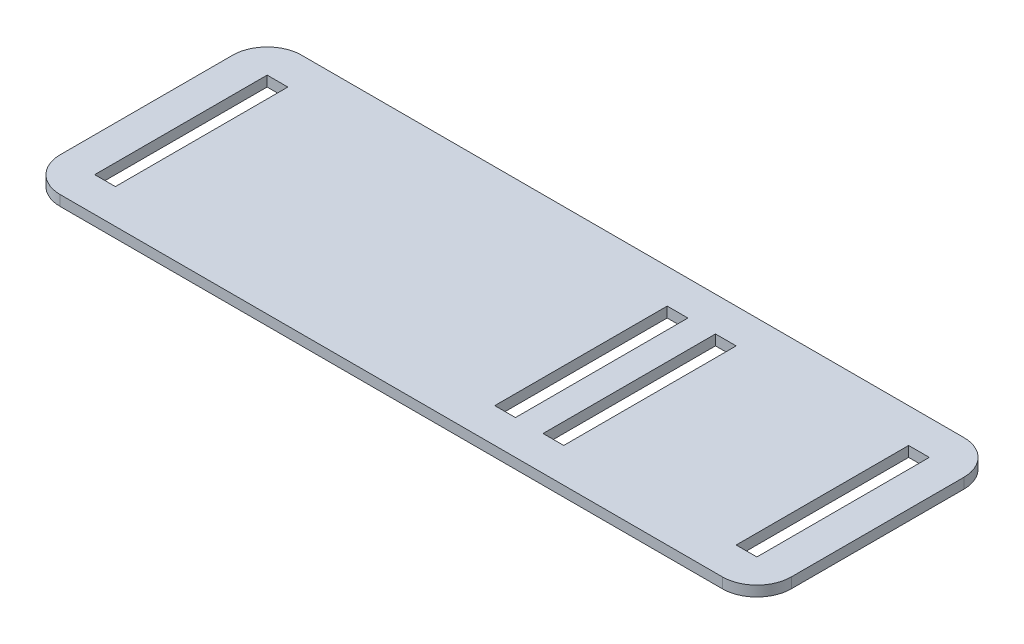
ISO-10303-21;
HEADER;
FILE_DESCRIPTION(('STEP AP214'),'2;1');
FILE_NAME('part.step','',(''),(''),'','','');
FILE_SCHEMA(('AUTOMOTIVE_DESIGN { 1 0 10303 214 1 1 1 1 }'));
ENDSEC;
DATA;
#1=APPLICATION_CONTEXT('core data for automotive mechanical design processes');
#2=APPLICATION_PROTOCOL_DEFINITION('international standard','automotive_design',2000,#1);
#3=PRODUCT_CONTEXT('',#1,'mechanical');
#4=PRODUCT('Part','Part','',(#3));
#5=PRODUCT_RELATED_PRODUCT_CATEGORY('part','',(#4));
#6=PRODUCT_DEFINITION_FORMATION('','',#4);
#7=PRODUCT_DEFINITION_CONTEXT('part definition',#1,'design');
#8=PRODUCT_DEFINITION('design','',#6,#7);
#9=PRODUCT_DEFINITION_SHAPE('','',#8);
#10=(LENGTH_UNIT() NAMED_UNIT(*) SI_UNIT(.MILLI.,.METRE.));
#11=(NAMED_UNIT(*) PLANE_ANGLE_UNIT() SI_UNIT($,.RADIAN.));
#12=(NAMED_UNIT(*) SI_UNIT($,.STERADIAN.) SOLID_ANGLE_UNIT());
#13=UNCERTAINTY_MEASURE_WITH_UNIT(LENGTH_MEASURE(1.E-05),#10,'distance_accuracy_value','');
#14=(GEOMETRIC_REPRESENTATION_CONTEXT(3) GLOBAL_UNCERTAINTY_ASSIGNED_CONTEXT((#13)) GLOBAL_UNIT_ASSIGNED_CONTEXT((#10,
#11,#12)) REPRESENTATION_CONTEXT('',''));
#15=CARTESIAN_POINT('',(0.,0.,0.));
#16=DIRECTION('',(0.,0.,1.));
#17=DIRECTION('',(1.,0.,0.));
#18=AXIS2_PLACEMENT_3D('',#15,#16,#17);
#19=CARTESIAN_POINT('',(106.,3.,35.));
#20=DIRECTION('',(-1.,0.,0.));
#21=DIRECTION('',(0.,0.,1.));
#22=AXIS2_PLACEMENT_3D('',#19,#20,#21);
#23=PLANE('',#22);
#24=DIRECTION('',(0.,0.,-1.));
#25=VECTOR('',#24,1.);
#26=CARTESIAN_POINT('',(106.,3.,35.));
#27=LINE('',#26,#25);
#28=CARTESIAN_POINT('',(106.,3.,25.));
#29=VERTEX_POINT('',#28);
#30=CARTESIAN_POINT('',(106.,3.,-25.));
#31=VERTEX_POINT('',#30);
#32=EDGE_CURVE('E348',#29,#31,#27,.T.);
#33=ORIENTED_EDGE('',*,*,#32,.F.);
#34=DIRECTION('',(0.,-1.,0.));
#35=VECTOR('',#34,1.);
#36=CARTESIAN_POINT('',(106.,3.,25.));
#37=LINE('',#36,#35);
#38=CARTESIAN_POINT('',(106.,0.,25.));
#39=VERTEX_POINT('',#38);
#40=EDGE_CURVE('E395',#29,#39,#37,.T.);
#41=ORIENTED_EDGE('',*,*,#40,.T.);
#42=DIRECTION('',(0.,0.,-1.));
#43=VECTOR('',#42,1.);
#44=CARTESIAN_POINT('',(106.,0.,35.));
#45=LINE('',#44,#43);
#46=CARTESIAN_POINT('',(106.,0.,-25.));
#47=VERTEX_POINT('',#46);
#48=EDGE_CURVE('E347',#39,#47,#45,.T.);
#49=ORIENTED_EDGE('',*,*,#48,.T.);
#50=DIRECTION('',(0.,-1.,0.));
#51=VECTOR('',#50,1.);
#52=CARTESIAN_POINT('',(106.,3.,-25.));
#53=LINE('',#52,#51);
#54=EDGE_CURVE('E393',#47,#31,#53,.F.);
#55=ORIENTED_EDGE('',*,*,#54,.T.);
#56=EDGE_LOOP('',(#33,#41,#49,#55));
#57=FACE_BOUND('',#56,.T.);
#58=ADVANCED_FACE('F35',(#57),#23,.F.);
#59=CARTESIAN_POINT('',(-106.,3.,-35.));
#60=DIRECTION('',(0.,0.,1.));
#61=DIRECTION('',(1.,0.,0.));
#62=AXIS2_PLACEMENT_3D('',#59,#60,#61);
#63=PLANE('',#62);
#64=DIRECTION('',(-1.,0.,0.));
#65=VECTOR('',#64,1.);
#66=CARTESIAN_POINT('',(-106.,3.,-35.));
#67=LINE('',#66,#65);
#68=CARTESIAN_POINT('',(96.,3.,-35.));
#69=VERTEX_POINT('',#68);
#70=CARTESIAN_POINT('',(-96.,3.,-35.));
#71=VERTEX_POINT('',#70);
#72=EDGE_CURVE('E350',#69,#71,#67,.T.);
#73=ORIENTED_EDGE('',*,*,#72,.F.);
#74=DIRECTION('',(0.,-1.,0.));
#75=VECTOR('',#74,1.);
#76=CARTESIAN_POINT('',(96.,3.,-35.));
#77=LINE('',#76,#75);
#78=CARTESIAN_POINT('',(96.,0.,-35.));
#79=VERTEX_POINT('',#78);
#80=EDGE_CURVE('E11',#69,#79,#77,.T.);
#81=ORIENTED_EDGE('',*,*,#80,.T.);
#82=DIRECTION('',(-1.,0.,0.));
#83=VECTOR('',#82,1.);
#84=CARTESIAN_POINT('',(-106.,0.,-35.));
#85=LINE('',#84,#83);
#86=CARTESIAN_POINT('',(-96.,0.,-35.));
#87=VERTEX_POINT('',#86);
#88=EDGE_CURVE('E362',#79,#87,#85,.T.);
#89=ORIENTED_EDGE('',*,*,#88,.T.);
#90=DIRECTION('',(0.,-1.,0.));
#91=VECTOR('',#90,1.);
#92=CARTESIAN_POINT('',(-96.,3.,-35.));
#93=LINE('',#92,#91);
#94=EDGE_CURVE('E43',#87,#71,#93,.F.);
#95=ORIENTED_EDGE('',*,*,#94,.T.);
#96=EDGE_LOOP('',(#73,#81,#89,#95));
#97=FACE_BOUND('',#96,.T.);
#98=ADVANCED_FACE('F410',(#97),#63,.F.);
#99=CARTESIAN_POINT('',(-106.,3.,35.));
#100=DIRECTION('',(1.,0.,0.));
#101=DIRECTION('',(0.,0.,-1.));
#102=AXIS2_PLACEMENT_3D('',#99,#100,#101);
#103=PLANE('',#102);
#104=DIRECTION('',(0.,0.,1.));
#105=VECTOR('',#104,1.);
#106=CARTESIAN_POINT('',(-106.,0.,35.));
#107=LINE('',#106,#105);
#108=CARTESIAN_POINT('',(-106.,0.,-25.));
#109=VERTEX_POINT('',#108);
#110=CARTESIAN_POINT('',(-106.,0.,25.));
#111=VERTEX_POINT('',#110);
#112=EDGE_CURVE('E364',#109,#111,#107,.T.);
#113=ORIENTED_EDGE('',*,*,#112,.T.);
#114=DIRECTION('',(0.,-1.,0.));
#115=VECTOR('',#114,1.);
#116=CARTESIAN_POINT('',(-106.,3.,25.));
#117=LINE('',#116,#115);
#118=CARTESIAN_POINT('',(-106.,3.,25.));
#119=VERTEX_POINT('',#118);
#120=EDGE_CURVE('E384',#111,#119,#117,.F.);
#121=ORIENTED_EDGE('',*,*,#120,.T.);
#122=DIRECTION('',(0.,0.,1.));
#123=VECTOR('',#122,1.);
#124=CARTESIAN_POINT('',(-106.,3.,35.));
#125=LINE('',#124,#123);
#126=CARTESIAN_POINT('',(-106.,3.,-25.));
#127=VERTEX_POINT('',#126);
#128=EDGE_CURVE('E353',#127,#119,#125,.T.);
#129=ORIENTED_EDGE('',*,*,#128,.F.);
#130=DIRECTION('',(0.,-1.,0.));
#131=VECTOR('',#130,1.);
#132=CARTESIAN_POINT('',(-106.,3.,-25.));
#133=LINE('',#132,#131);
#134=EDGE_CURVE('E381',#127,#109,#133,.T.);
#135=ORIENTED_EDGE('',*,*,#134,.T.);
#136=EDGE_LOOP('',(#113,#121,#129,#135));
#137=FACE_BOUND('',#136,.T.);
#138=ADVANCED_FACE('F418',(#137),#103,.F.);
#139=CARTESIAN_POINT('',(-106.,3.,35.));
#140=DIRECTION('',(0.,0.,-1.));
#141=DIRECTION('',(-1.,0.,0.));
#142=AXIS2_PLACEMENT_3D('',#139,#140,#141);
#143=PLANE('',#142);
#144=DIRECTION('',(1.,0.,0.));
#145=VECTOR('',#144,1.);
#146=CARTESIAN_POINT('',(-106.,3.,35.));
#147=LINE('',#146,#145);
#148=CARTESIAN_POINT('',(-96.,3.,35.));
#149=VERTEX_POINT('',#148);
#150=CARTESIAN_POINT('',(96.,3.,35.));
#151=VERTEX_POINT('',#150);
#152=EDGE_CURVE('E356',#149,#151,#147,.T.);
#153=ORIENTED_EDGE('',*,*,#152,.F.);
#154=DIRECTION('',(0.,-1.,0.));
#155=VECTOR('',#154,1.);
#156=CARTESIAN_POINT('',(-96.,3.,35.));
#157=LINE('',#156,#155);
#158=CARTESIAN_POINT('',(-96.,0.,35.));
#159=VERTEX_POINT('',#158);
#160=EDGE_CURVE('E370',#149,#159,#157,.T.);
#161=ORIENTED_EDGE('',*,*,#160,.T.);
#162=DIRECTION('',(1.,0.,0.));
#163=VECTOR('',#162,1.);
#164=CARTESIAN_POINT('',(-106.,0.,35.));
#165=LINE('',#164,#163);
#166=CARTESIAN_POINT('',(96.,0.,35.));
#167=VERTEX_POINT('',#166);
#168=EDGE_CURVE('E351',#159,#167,#165,.T.);
#169=ORIENTED_EDGE('',*,*,#168,.T.);
#170=DIRECTION('',(0.,-1.,0.));
#171=VECTOR('',#170,1.);
#172=CARTESIAN_POINT('',(96.,3.,35.));
#173=LINE('',#172,#171);
#174=EDGE_CURVE('E359',#167,#151,#173,.F.);
#175=ORIENTED_EDGE('',*,*,#174,.T.);
#176=EDGE_LOOP('',(#153,#161,#169,#175));
#177=FACE_BOUND('',#176,.T.);
#178=ADVANCED_FACE('F426',(#177),#143,.F.);
#179=CARTESIAN_POINT('',(0.,3.,0.));
#180=DIRECTION('',(0.,-1.,0.));
#181=DIRECTION('',(0.,0.,-1.));
#182=AXIS2_PLACEMENT_3D('',#179,#180,#181);
#183=PLANE('',#182);
#184=DIRECTION('',(1.,0.,0.));
#185=VECTOR('',#184,1.);
#186=CARTESIAN_POINT('',(0.,3.,-25.));
#187=LINE('',#186,#185);
#188=CARTESIAN_POINT('',(-96.,3.,-25.));
#189=VERTEX_POINT('',#188);
#190=CARTESIAN_POINT('',(-90.,3.,-25.));
#191=VERTEX_POINT('',#190);
#192=EDGE_CURVE('E338',#189,#191,#187,.T.);
#193=ORIENTED_EDGE('',*,*,#192,.T.);
#194=DIRECTION('',(0.,0.,1.));
#195=VECTOR('',#194,1.);
#196=CARTESIAN_POINT('',(-90.,3.,0.));
#197=LINE('',#196,#195);
#198=CARTESIAN_POINT('',(-90.,3.,25.));
#199=VERTEX_POINT('',#198);
#200=EDGE_CURVE('E205',#191,#199,#197,.T.);
#201=ORIENTED_EDGE('',*,*,#200,.T.);
#202=DIRECTION('',(-1.,0.,0.));
#203=VECTOR('',#202,1.);
#204=CARTESIAN_POINT('',(0.,3.,25.));
#205=LINE('',#204,#203);
#206=CARTESIAN_POINT('',(-96.,3.,25.));
#207=VERTEX_POINT('',#206);
#208=EDGE_CURVE('E343',#199,#207,#205,.T.);
#209=ORIENTED_EDGE('',*,*,#208,.T.);
#210=DIRECTION('',(0.,0.,-1.));
#211=VECTOR('',#210,1.);
#212=CARTESIAN_POINT('',(-96.,3.,0.));
#213=LINE('',#212,#211);
#214=EDGE_CURVE('E340',#207,#189,#213,.T.);
#215=ORIENTED_EDGE('',*,*,#214,.T.);
#216=EDGE_LOOP('',(#193,#201,#209,#215));
#217=FACE_BOUND('',#216,.T.);
#218=DIRECTION('',(1.,0.,0.));
#219=VECTOR('',#218,1.);
#220=CARTESIAN_POINT('',(0.,3.,-25.));
#221=LINE('',#220,#219);
#222=CARTESIAN_POINT('',(20.,3.,-25.));
#223=VERTEX_POINT('',#222);
#224=CARTESIAN_POINT('',(26.,3.,-25.));
#225=VERTEX_POINT('',#224);
#226=EDGE_CURVE('E326',#223,#225,#221,.T.);
#227=ORIENTED_EDGE('',*,*,#226,.T.);
#228=DIRECTION('',(0.,0.,1.));
#229=VECTOR('',#228,1.);
#230=CARTESIAN_POINT('',(26.,3.,0.));
#231=LINE('',#230,#229);
#232=CARTESIAN_POINT('',(26.,3.,25.));
#233=VERTEX_POINT('',#232);
#234=EDGE_CURVE('E335',#225,#233,#231,.T.);
#235=ORIENTED_EDGE('',*,*,#234,.T.);
#236=DIRECTION('',(-1.,0.,0.));
#237=VECTOR('',#236,1.);
#238=CARTESIAN_POINT('',(0.,3.,25.));
#239=LINE('',#238,#237);
#240=CARTESIAN_POINT('',(20.,3.,25.));
#241=VERTEX_POINT('',#240);
#242=EDGE_CURVE('E332',#233,#241,#239,.T.);
#243=ORIENTED_EDGE('',*,*,#242,.T.);
#244=DIRECTION('',(0.,0.,-1.));
#245=VECTOR('',#244,1.);
#246=CARTESIAN_POINT('',(20.,3.,0.));
#247=LINE('',#246,#245);
#248=EDGE_CURVE('E329',#241,#223,#247,.T.);
#249=ORIENTED_EDGE('',*,*,#248,.T.);
#250=EDGE_LOOP('',(#227,#235,#243,#249));
#251=FACE_BOUND('',#250,.T.);
#252=DIRECTION('',(1.,0.,0.));
#253=VECTOR('',#252,1.);
#254=CARTESIAN_POINT('',(0.,3.,-25.));
#255=LINE('',#254,#253);
#256=CARTESIAN_POINT('',(34.,3.,-25.));
#257=VERTEX_POINT('',#256);
#258=CARTESIAN_POINT('',(40.,3.,-25.));
#259=VERTEX_POINT('',#258);
#260=EDGE_CURVE('E314',#257,#259,#255,.T.);
#261=ORIENTED_EDGE('',*,*,#260,.T.);
#262=DIRECTION('',(0.,0.,1.));
#263=VECTOR('',#262,1.);
#264=CARTESIAN_POINT('',(40.,3.,0.));
#265=LINE('',#264,#263);
#266=CARTESIAN_POINT('',(40.,3.,25.));
#267=VERTEX_POINT('',#266);
#268=EDGE_CURVE('E323',#259,#267,#265,.T.);
#269=ORIENTED_EDGE('',*,*,#268,.T.);
#270=DIRECTION('',(-1.,0.,0.));
#271=VECTOR('',#270,1.);
#272=CARTESIAN_POINT('',(0.,3.,25.));
#273=LINE('',#272,#271);
#274=CARTESIAN_POINT('',(34.,3.,25.));
#275=VERTEX_POINT('',#274);
#276=EDGE_CURVE('E320',#267,#275,#273,.T.);
#277=ORIENTED_EDGE('',*,*,#276,.T.);
#278=DIRECTION('',(0.,0.,-1.));
#279=VECTOR('',#278,1.);
#280=CARTESIAN_POINT('',(34.,3.,0.));
#281=LINE('',#280,#279);
#282=EDGE_CURVE('E317',#275,#257,#281,.T.);
#283=ORIENTED_EDGE('',*,*,#282,.T.);
#284=EDGE_LOOP('',(#261,#269,#277,#283));
#285=FACE_BOUND('',#284,.T.);
#286=DIRECTION('',(1.,0.,0.));
#287=VECTOR('',#286,1.);
#288=CARTESIAN_POINT('',(0.,3.,-25.));
#289=LINE('',#288,#287);
#290=CARTESIAN_POINT('',(90.,3.,-25.));
#291=VERTEX_POINT('',#290);
#292=CARTESIAN_POINT('',(96.,3.,-25.));
#293=VERTEX_POINT('',#292);
#294=EDGE_CURVE('E233',#291,#293,#289,.T.);
#295=ORIENTED_EDGE('',*,*,#294,.T.);
#296=DIRECTION('',(0.,0.,1.));
#297=VECTOR('',#296,1.);
#298=CARTESIAN_POINT('',(96.,3.,0.));
#299=LINE('',#298,#297);
#300=CARTESIAN_POINT('',(96.,3.,25.));
#301=VERTEX_POINT('',#300);
#302=EDGE_CURVE('E311',#293,#301,#299,.T.);
#303=ORIENTED_EDGE('',*,*,#302,.T.);
#304=DIRECTION('',(-1.,0.,0.));
#305=VECTOR('',#304,1.);
#306=CARTESIAN_POINT('',(0.,3.,25.));
#307=LINE('',#306,#305);
#308=CARTESIAN_POINT('',(90.,3.,25.));
#309=VERTEX_POINT('',#308);
#310=EDGE_CURVE('E308',#301,#309,#307,.T.);
#311=ORIENTED_EDGE('',*,*,#310,.T.);
#312=DIRECTION('',(0.,0.,-1.));
#313=VECTOR('',#312,1.);
#314=CARTESIAN_POINT('',(90.,3.,0.));
#315=LINE('',#314,#313);
#316=EDGE_CURVE('E305',#309,#291,#315,.T.);
#317=ORIENTED_EDGE('',*,*,#316,.T.);
#318=EDGE_LOOP('',(#295,#303,#311,#317));
#319=FACE_BOUND('',#318,.T.);
#320=ORIENTED_EDGE('',*,*,#128,.T.);
#321=CARTESIAN_POINT('',(-96.,3.,25.));
#322=DIRECTION('',(0.,-1.,0.));
#323=DIRECTION('',(0.,0.,-1.));
#324=AXIS2_PLACEMENT_3D('',#321,#322,#323);
#325=CIRCLE('',#324,10.);
#326=EDGE_CURVE('E391',#119,#149,#325,.F.);
#327=ORIENTED_EDGE('',*,*,#326,.T.);
#328=ORIENTED_EDGE('',*,*,#152,.T.);
#329=CARTESIAN_POINT('',(96.,3.,25.));
#330=DIRECTION('',(0.,-1.,0.));
#331=DIRECTION('',(0.,0.,-1.));
#332=AXIS2_PLACEMENT_3D('',#329,#330,#331);
#333=CIRCLE('',#332,10.);
#334=EDGE_CURVE('E389',#151,#29,#333,.F.);
#335=ORIENTED_EDGE('',*,*,#334,.T.);
#336=ORIENTED_EDGE('',*,*,#32,.T.);
#337=CARTESIAN_POINT('',(96.,3.,-25.));
#338=DIRECTION('',(0.,-1.,0.));
#339=DIRECTION('',(0.,0.,-1.));
#340=AXIS2_PLACEMENT_3D('',#337,#338,#339);
#341=CIRCLE('',#340,10.);
#342=EDGE_CURVE('E56',#31,#69,#341,.F.);
#343=ORIENTED_EDGE('',*,*,#342,.T.);
#344=ORIENTED_EDGE('',*,*,#72,.T.);
#345=CARTESIAN_POINT('',(-96.,3.,-25.));
#346=DIRECTION('',(0.,-1.,0.));
#347=DIRECTION('',(0.,0.,-1.));
#348=AXIS2_PLACEMENT_3D('',#345,#346,#347);
#349=CIRCLE('',#348,10.);
#350=EDGE_CURVE('E386',#71,#127,#349,.F.);
#351=ORIENTED_EDGE('',*,*,#350,.T.);
#352=EDGE_LOOP('',(#320,#327,#328,#335,#336,#343,#344,#351));
#353=FACE_BOUND('',#352,.T.);
#354=ADVANCED_FACE('F412',(#217,#251,#285,#319,#353),#183,.F.);
#355=CARTESIAN_POINT('',(0.,0.,0.));
#356=DIRECTION('',(0.,-1.,0.));
#357=DIRECTION('',(0.,0.,-1.));
#358=AXIS2_PLACEMENT_3D('',#355,#356,#357);
#359=PLANE('',#358);
#360=DIRECTION('',(0.,0.,-1.));
#361=VECTOR('',#360,1.);
#362=CARTESIAN_POINT('',(-90.,0.,25.));
#363=LINE('',#362,#361);
#364=CARTESIAN_POINT('',(-90.,0.,25.));
#365=VERTEX_POINT('',#364);
#366=CARTESIAN_POINT('',(-90.,0.,-25.));
#367=VERTEX_POINT('',#366);
#368=EDGE_CURVE('E202',#365,#367,#363,.T.);
#369=ORIENTED_EDGE('',*,*,#368,.T.);
#370=DIRECTION('',(-1.,0.,0.));
#371=VECTOR('',#370,1.);
#372=CARTESIAN_POINT('',(-96.,0.,-25.));
#373=LINE('',#372,#371);
#374=CARTESIAN_POINT('',(-96.,0.,-25.));
#375=VERTEX_POINT('',#374);
#376=EDGE_CURVE('E213',#367,#375,#373,.T.);
#377=ORIENTED_EDGE('',*,*,#376,.T.);
#378=DIRECTION('',(0.,0.,1.));
#379=VECTOR('',#378,1.);
#380=CARTESIAN_POINT('',(-96.,0.,25.));
#381=LINE('',#380,#379);
#382=CARTESIAN_POINT('',(-96.,0.,25.));
#383=VERTEX_POINT('',#382);
#384=EDGE_CURVE('E218',#375,#383,#381,.T.);
#385=ORIENTED_EDGE('',*,*,#384,.T.);
#386=DIRECTION('',(1.,0.,0.));
#387=VECTOR('',#386,1.);
#388=CARTESIAN_POINT('',(-96.,0.,25.));
#389=LINE('',#388,#387);
#390=EDGE_CURVE('E209',#383,#365,#389,.T.);
#391=ORIENTED_EDGE('',*,*,#390,.T.);
#392=EDGE_LOOP('',(#369,#377,#385,#391));
#393=FACE_BOUND('',#392,.T.);
#394=DIRECTION('',(0.,0.,-1.));
#395=VECTOR('',#394,1.);
#396=CARTESIAN_POINT('',(26.,0.,25.));
#397=LINE('',#396,#395);
#398=CARTESIAN_POINT('',(26.,0.,25.));
#399=VERTEX_POINT('',#398);
#400=CARTESIAN_POINT('',(26.,0.,-25.));
#401=VERTEX_POINT('',#400);
#402=EDGE_CURVE('E238',#399,#401,#397,.T.);
#403=ORIENTED_EDGE('',*,*,#402,.T.);
#404=DIRECTION('',(-1.,0.,0.));
#405=VECTOR('',#404,1.);
#406=CARTESIAN_POINT('',(20.,0.,-25.));
#407=LINE('',#406,#405);
#408=CARTESIAN_POINT('',(20.,0.,-25.));
#409=VERTEX_POINT('',#408);
#410=EDGE_CURVE('E241',#401,#409,#407,.T.);
#411=ORIENTED_EDGE('',*,*,#410,.T.);
#412=DIRECTION('',(0.,0.,1.));
#413=VECTOR('',#412,1.);
#414=CARTESIAN_POINT('',(20.,0.,25.));
#415=LINE('',#414,#413);
#416=CARTESIAN_POINT('',(20.,0.,25.));
#417=VERTEX_POINT('',#416);
#418=EDGE_CURVE('E245',#409,#417,#415,.T.);
#419=ORIENTED_EDGE('',*,*,#418,.T.);
#420=DIRECTION('',(1.,0.,0.));
#421=VECTOR('',#420,1.);
#422=CARTESIAN_POINT('',(20.,0.,25.));
#423=LINE('',#422,#421);
#424=EDGE_CURVE('E248',#417,#399,#423,.T.);
#425=ORIENTED_EDGE('',*,*,#424,.T.);
#426=EDGE_LOOP('',(#403,#411,#419,#425));
#427=FACE_BOUND('',#426,.T.);
#428=DIRECTION('',(0.,0.,-1.));
#429=VECTOR('',#428,1.);
#430=CARTESIAN_POINT('',(40.,0.,25.));
#431=LINE('',#430,#429);
#432=CARTESIAN_POINT('',(40.,0.,25.));
#433=VERTEX_POINT('',#432);
#434=CARTESIAN_POINT('',(40.,0.,-25.));
#435=VERTEX_POINT('',#434);
#436=EDGE_CURVE('E258',#433,#435,#431,.T.);
#437=ORIENTED_EDGE('',*,*,#436,.T.);
#438=DIRECTION('',(-1.,0.,0.));
#439=VECTOR('',#438,1.);
#440=CARTESIAN_POINT('',(34.,0.,-25.));
#441=LINE('',#440,#439);
#442=CARTESIAN_POINT('',(34.,0.,-25.));
#443=VERTEX_POINT('',#442);
#444=EDGE_CURVE('E261',#435,#443,#441,.T.);
#445=ORIENTED_EDGE('',*,*,#444,.T.);
#446=DIRECTION('',(0.,0.,1.));
#447=VECTOR('',#446,1.);
#448=CARTESIAN_POINT('',(34.,0.,25.));
#449=LINE('',#448,#447);
#450=CARTESIAN_POINT('',(34.,0.,25.));
#451=VERTEX_POINT('',#450);
#452=EDGE_CURVE('E265',#443,#451,#449,.T.);
#453=ORIENTED_EDGE('',*,*,#452,.T.);
#454=DIRECTION('',(1.,0.,0.));
#455=VECTOR('',#454,1.);
#456=CARTESIAN_POINT('',(34.,0.,25.));
#457=LINE('',#456,#455);
#458=EDGE_CURVE('E268',#451,#433,#457,.T.);
#459=ORIENTED_EDGE('',*,*,#458,.T.);
#460=EDGE_LOOP('',(#437,#445,#453,#459));
#461=FACE_BOUND('',#460,.T.);
#462=DIRECTION('',(0.,0.,-1.));
#463=VECTOR('',#462,1.);
#464=CARTESIAN_POINT('',(96.,0.,25.));
#465=LINE('',#464,#463);
#466=CARTESIAN_POINT('',(96.,0.,25.));
#467=VERTEX_POINT('',#466);
#468=CARTESIAN_POINT('',(96.,0.,-25.));
#469=VERTEX_POINT('',#468);
#470=EDGE_CURVE('E281',#467,#469,#465,.T.);
#471=ORIENTED_EDGE('',*,*,#470,.T.);
#472=DIRECTION('',(-1.,0.,0.));
#473=VECTOR('',#472,1.);
#474=CARTESIAN_POINT('',(90.,0.,-25.));
#475=LINE('',#474,#473);
#476=CARTESIAN_POINT('',(90.,0.,-25.));
#477=VERTEX_POINT('',#476);
#478=EDGE_CURVE('E284',#469,#477,#475,.T.);
#479=ORIENTED_EDGE('',*,*,#478,.T.);
#480=DIRECTION('',(0.,0.,1.));
#481=VECTOR('',#480,1.);
#482=CARTESIAN_POINT('',(90.,0.,25.));
#483=LINE('',#482,#481);
#484=CARTESIAN_POINT('',(90.,0.,25.));
#485=VERTEX_POINT('',#484);
#486=EDGE_CURVE('E287',#477,#485,#483,.T.);
#487=ORIENTED_EDGE('',*,*,#486,.T.);
#488=DIRECTION('',(1.,0.,0.));
#489=VECTOR('',#488,1.);
#490=CARTESIAN_POINT('',(90.,0.,25.));
#491=LINE('',#490,#489);
#492=EDGE_CURVE('E290',#485,#467,#491,.T.);
#493=ORIENTED_EDGE('',*,*,#492,.T.);
#494=EDGE_LOOP('',(#471,#479,#487,#493));
#495=FACE_BOUND('',#494,.T.);
#496=ORIENTED_EDGE('',*,*,#168,.F.);
#497=CARTESIAN_POINT('',(-96.,0.,25.));
#498=DIRECTION('',(0.,-1.,0.));
#499=DIRECTION('',(0.,0.,-1.));
#500=AXIS2_PLACEMENT_3D('',#497,#498,#499);
#501=CIRCLE('',#500,10.);
#502=EDGE_CURVE('E379',#159,#111,#501,.T.);
#503=ORIENTED_EDGE('',*,*,#502,.T.);
#504=ORIENTED_EDGE('',*,*,#112,.F.);
#505=CARTESIAN_POINT('',(-96.,0.,-25.));
#506=DIRECTION('',(0.,-1.,0.));
#507=DIRECTION('',(0.,0.,-1.));
#508=AXIS2_PLACEMENT_3D('',#505,#506,#507);
#509=CIRCLE('',#508,10.);
#510=EDGE_CURVE('E373',#109,#87,#509,.T.);
#511=ORIENTED_EDGE('',*,*,#510,.T.);
#512=ORIENTED_EDGE('',*,*,#88,.F.);
#513=CARTESIAN_POINT('',(96.,0.,-25.));
#514=DIRECTION('',(0.,-1.,0.));
#515=DIRECTION('',(0.,0.,-1.));
#516=AXIS2_PLACEMENT_3D('',#513,#514,#515);
#517=CIRCLE('',#516,10.);
#518=EDGE_CURVE('E375',#79,#47,#517,.T.);
#519=ORIENTED_EDGE('',*,*,#518,.T.);
#520=ORIENTED_EDGE('',*,*,#48,.F.);
#521=CARTESIAN_POINT('',(96.,0.,25.));
#522=DIRECTION('',(0.,-1.,0.));
#523=DIRECTION('',(0.,0.,-1.));
#524=AXIS2_PLACEMENT_3D('',#521,#522,#523);
#525=CIRCLE('',#524,10.);
#526=EDGE_CURVE('E377',#39,#167,#525,.T.);
#527=ORIENTED_EDGE('',*,*,#526,.T.);
#528=EDGE_LOOP('',(#496,#503,#504,#511,#512,#519,#520,#527));
#529=FACE_BOUND('',#528,.T.);
#530=ADVANCED_FACE('F220',(#393,#427,#461,#495,#529),#359,.T.);
#531=CARTESIAN_POINT('',(96.,0.,25.));
#532=DIRECTION('',(1.,0.,0.));
#533=DIRECTION('',(0.,0.,-1.));
#534=AXIS2_PLACEMENT_3D('',#531,#532,#533);
#535=PLANE('',#534);
#536=DIRECTION('',(0.,1.,0.));
#537=VECTOR('',#536,1.);
#538=CARTESIAN_POINT('',(96.,0.,-25.));
#539=LINE('',#538,#537);
#540=EDGE_CURVE('E293',#469,#293,#539,.T.);
#541=ORIENTED_EDGE('',*,*,#540,.F.);
#542=ORIENTED_EDGE('',*,*,#470,.F.);
#543=DIRECTION('',(0.,1.,0.));
#544=VECTOR('',#543,1.);
#545=CARTESIAN_POINT('',(96.,0.,25.));
#546=LINE('',#545,#544);
#547=EDGE_CURVE('E262',#467,#301,#546,.T.);
#548=ORIENTED_EDGE('',*,*,#547,.T.);
#549=ORIENTED_EDGE('',*,*,#302,.F.);
#550=EDGE_LOOP('',(#541,#542,#548,#549));
#551=FACE_BOUND('',#550,.T.);
#552=ADVANCED_FACE('F449',(#551),#535,.F.);
#553=CARTESIAN_POINT('',(90.,0.,25.));
#554=DIRECTION('',(0.,0.,1.));
#555=DIRECTION('',(1.,0.,0.));
#556=AXIS2_PLACEMENT_3D('',#553,#554,#555);
#557=PLANE('',#556);
#558=ORIENTED_EDGE('',*,*,#547,.F.);
#559=ORIENTED_EDGE('',*,*,#492,.F.);
#560=DIRECTION('',(0.,1.,0.));
#561=VECTOR('',#560,1.);
#562=CARTESIAN_POINT('',(90.,0.,25.));
#563=LINE('',#562,#561);
#564=EDGE_CURVE('E296',#485,#309,#563,.T.);
#565=ORIENTED_EDGE('',*,*,#564,.T.);
#566=ORIENTED_EDGE('',*,*,#310,.F.);
#567=EDGE_LOOP('',(#558,#559,#565,#566));
#568=FACE_BOUND('',#567,.T.);
#569=ADVANCED_FACE('F455',(#568),#557,.F.);
#570=CARTESIAN_POINT('',(90.,0.,25.));
#571=DIRECTION('',(-1.,0.,0.));
#572=DIRECTION('',(0.,0.,1.));
#573=AXIS2_PLACEMENT_3D('',#570,#571,#572);
#574=PLANE('',#573);
#575=ORIENTED_EDGE('',*,*,#564,.F.);
#576=ORIENTED_EDGE('',*,*,#486,.F.);
#577=DIRECTION('',(0.,1.,0.));
#578=VECTOR('',#577,1.);
#579=CARTESIAN_POINT('',(90.,0.,-25.));
#580=LINE('',#579,#578);
#581=EDGE_CURVE('E299',#477,#291,#580,.T.);
#582=ORIENTED_EDGE('',*,*,#581,.T.);
#583=ORIENTED_EDGE('',*,*,#316,.F.);
#584=EDGE_LOOP('',(#575,#576,#582,#583));
#585=FACE_BOUND('',#584,.T.);
#586=ADVANCED_FACE('F461',(#585),#574,.F.);
#587=CARTESIAN_POINT('',(90.,0.,-25.));
#588=DIRECTION('',(0.,0.,-1.));
#589=DIRECTION('',(-1.,0.,0.));
#590=AXIS2_PLACEMENT_3D('',#587,#588,#589);
#591=PLANE('',#590);
#592=ORIENTED_EDGE('',*,*,#581,.F.);
#593=ORIENTED_EDGE('',*,*,#478,.F.);
#594=ORIENTED_EDGE('',*,*,#540,.T.);
#595=ORIENTED_EDGE('',*,*,#294,.F.);
#596=EDGE_LOOP('',(#592,#593,#594,#595));
#597=FACE_BOUND('',#596,.T.);
#598=ADVANCED_FACE('F457',(#597),#591,.F.);
#599=CARTESIAN_POINT('',(40.,0.,25.));
#600=DIRECTION('',(1.,0.,0.));
#601=DIRECTION('',(0.,0.,-1.));
#602=AXIS2_PLACEMENT_3D('',#599,#600,#601);
#603=PLANE('',#602);
#604=DIRECTION('',(0.,1.,0.));
#605=VECTOR('',#604,1.);
#606=CARTESIAN_POINT('',(40.,0.,-25.));
#607=LINE('',#606,#605);
#608=EDGE_CURVE('E271',#435,#259,#607,.T.);
#609=ORIENTED_EDGE('',*,*,#608,.F.);
#610=ORIENTED_EDGE('',*,*,#436,.F.);
#611=DIRECTION('',(0.,1.,0.));
#612=VECTOR('',#611,1.);
#613=CARTESIAN_POINT('',(40.,0.,25.));
#614=LINE('',#613,#612);
#615=EDGE_CURVE('E242',#433,#267,#614,.T.);
#616=ORIENTED_EDGE('',*,*,#615,.T.);
#617=ORIENTED_EDGE('',*,*,#268,.F.);
#618=EDGE_LOOP('',(#609,#610,#616,#617));
#619=FACE_BOUND('',#618,.T.);
#620=ADVANCED_FACE('F460',(#619),#603,.F.);
#621=CARTESIAN_POINT('',(34.,0.,25.));
#622=DIRECTION('',(0.,0.,1.));
#623=DIRECTION('',(1.,0.,0.));
#624=AXIS2_PLACEMENT_3D('',#621,#622,#623);
#625=PLANE('',#624);
#626=ORIENTED_EDGE('',*,*,#615,.F.);
#627=ORIENTED_EDGE('',*,*,#458,.F.);
#628=DIRECTION('',(0.,1.,0.));
#629=VECTOR('',#628,1.);
#630=CARTESIAN_POINT('',(34.,0.,25.));
#631=LINE('',#630,#629);
#632=EDGE_CURVE('E274',#451,#275,#631,.T.);
#633=ORIENTED_EDGE('',*,*,#632,.T.);
#634=ORIENTED_EDGE('',*,*,#276,.F.);
#635=EDGE_LOOP('',(#626,#627,#633,#634));
#636=FACE_BOUND('',#635,.T.);
#637=ADVANCED_FACE('F471',(#636),#625,.F.);
#638=CARTESIAN_POINT('',(34.,0.,25.));
#639=DIRECTION('',(-1.,0.,0.));
#640=DIRECTION('',(0.,0.,1.));
#641=AXIS2_PLACEMENT_3D('',#638,#639,#640);
#642=PLANE('',#641);
#643=ORIENTED_EDGE('',*,*,#632,.F.);
#644=ORIENTED_EDGE('',*,*,#452,.F.);
#645=DIRECTION('',(0.,1.,0.));
#646=VECTOR('',#645,1.);
#647=CARTESIAN_POINT('',(34.,0.,-25.));
#648=LINE('',#647,#646);
#649=EDGE_CURVE('E277',#443,#257,#648,.T.);
#650=ORIENTED_EDGE('',*,*,#649,.T.);
#651=ORIENTED_EDGE('',*,*,#282,.F.);
#652=EDGE_LOOP('',(#643,#644,#650,#651));
#653=FACE_BOUND('',#652,.T.);
#654=ADVANCED_FACE('F477',(#653),#642,.F.);
#655=CARTESIAN_POINT('',(34.,0.,-25.));
#656=DIRECTION('',(0.,0.,-1.));
#657=DIRECTION('',(-1.,0.,0.));
#658=AXIS2_PLACEMENT_3D('',#655,#656,#657);
#659=PLANE('',#658);
#660=ORIENTED_EDGE('',*,*,#649,.F.);
#661=ORIENTED_EDGE('',*,*,#444,.F.);
#662=ORIENTED_EDGE('',*,*,#608,.T.);
#663=ORIENTED_EDGE('',*,*,#260,.F.);
#664=EDGE_LOOP('',(#660,#661,#662,#663));
#665=FACE_BOUND('',#664,.T.);
#666=ADVANCED_FACE('F473',(#665),#659,.F.);
#667=CARTESIAN_POINT('',(26.,0.,25.));
#668=DIRECTION('',(1.,0.,0.));
#669=DIRECTION('',(0.,0.,-1.));
#670=AXIS2_PLACEMENT_3D('',#667,#668,#669);
#671=PLANE('',#670);
#672=DIRECTION('',(0.,1.,0.));
#673=VECTOR('',#672,1.);
#674=CARTESIAN_POINT('',(26.,0.,-25.));
#675=LINE('',#674,#673);
#676=EDGE_CURVE('E250',#401,#225,#675,.T.);
#677=ORIENTED_EDGE('',*,*,#676,.F.);
#678=ORIENTED_EDGE('',*,*,#402,.F.);
#679=DIRECTION('',(0.,1.,0.));
#680=VECTOR('',#679,1.);
#681=CARTESIAN_POINT('',(26.,0.,25.));
#682=LINE('',#681,#680);
#683=EDGE_CURVE('E223',#399,#233,#682,.T.);
#684=ORIENTED_EDGE('',*,*,#683,.T.);
#685=ORIENTED_EDGE('',*,*,#234,.F.);
#686=EDGE_LOOP('',(#677,#678,#684,#685));
#687=FACE_BOUND('',#686,.T.);
#688=ADVANCED_FACE('F476',(#687),#671,.F.);
#689=CARTESIAN_POINT('',(20.,0.,25.));
#690=DIRECTION('',(0.,0.,1.));
#691=DIRECTION('',(1.,0.,0.));
#692=AXIS2_PLACEMENT_3D('',#689,#690,#691);
#693=PLANE('',#692);
#694=ORIENTED_EDGE('',*,*,#683,.F.);
#695=ORIENTED_EDGE('',*,*,#424,.F.);
#696=DIRECTION('',(0.,1.,0.));
#697=VECTOR('',#696,1.);
#698=CARTESIAN_POINT('',(20.,0.,25.));
#699=LINE('',#698,#697);
#700=EDGE_CURVE('E226',#417,#241,#699,.T.);
#701=ORIENTED_EDGE('',*,*,#700,.T.);
#702=ORIENTED_EDGE('',*,*,#242,.F.);
#703=EDGE_LOOP('',(#694,#695,#701,#702));
#704=FACE_BOUND('',#703,.T.);
#705=ADVANCED_FACE('F487',(#704),#693,.F.);
#706=CARTESIAN_POINT('',(20.,0.,25.));
#707=DIRECTION('',(-1.,0.,0.));
#708=DIRECTION('',(0.,0.,1.));
#709=AXIS2_PLACEMENT_3D('',#706,#707,#708);
#710=PLANE('',#709);
#711=ORIENTED_EDGE('',*,*,#700,.F.);
#712=ORIENTED_EDGE('',*,*,#418,.F.);
#713=DIRECTION('',(0.,1.,0.));
#714=VECTOR('',#713,1.);
#715=CARTESIAN_POINT('',(20.,0.,-25.));
#716=LINE('',#715,#714);
#717=EDGE_CURVE('E254',#409,#223,#716,.T.);
#718=ORIENTED_EDGE('',*,*,#717,.T.);
#719=ORIENTED_EDGE('',*,*,#248,.F.);
#720=EDGE_LOOP('',(#711,#712,#718,#719));
#721=FACE_BOUND('',#720,.T.);
#722=ADVANCED_FACE('F492',(#721),#710,.F.);
#723=CARTESIAN_POINT('',(20.,0.,-25.));
#724=DIRECTION('',(0.,0.,-1.));
#725=DIRECTION('',(-1.,0.,0.));
#726=AXIS2_PLACEMENT_3D('',#723,#724,#725);
#727=PLANE('',#726);
#728=ORIENTED_EDGE('',*,*,#717,.F.);
#729=ORIENTED_EDGE('',*,*,#410,.F.);
#730=ORIENTED_EDGE('',*,*,#676,.T.);
#731=ORIENTED_EDGE('',*,*,#226,.F.);
#732=EDGE_LOOP('',(#728,#729,#730,#731));
#733=FACE_BOUND('',#732,.T.);
#734=ADVANCED_FACE('F489',(#733),#727,.F.);
#735=CARTESIAN_POINT('',(-90.,0.,25.));
#736=DIRECTION('',(1.,0.,0.));
#737=DIRECTION('',(0.,0.,-1.));
#738=AXIS2_PLACEMENT_3D('',#735,#736,#737);
#739=PLANE('',#738);
#740=DIRECTION('',(0.,1.,0.));
#741=VECTOR('',#740,1.);
#742=CARTESIAN_POINT('',(-90.,0.,-25.));
#743=LINE('',#742,#741);
#744=EDGE_CURVE('E197',#367,#191,#743,.T.);
#745=ORIENTED_EDGE('',*,*,#744,.F.);
#746=ORIENTED_EDGE('',*,*,#368,.F.);
#747=DIRECTION('',(0.,1.,0.));
#748=VECTOR('',#747,1.);
#749=CARTESIAN_POINT('',(-90.,0.,25.));
#750=LINE('',#749,#748);
#751=EDGE_CURVE('E231',#365,#199,#750,.T.);
#752=ORIENTED_EDGE('',*,*,#751,.T.);
#753=ORIENTED_EDGE('',*,*,#200,.F.);
#754=EDGE_LOOP('',(#745,#746,#752,#753));
#755=FACE_BOUND('',#754,.T.);
#756=ADVANCED_FACE('F199',(#755),#739,.F.);
#757=CARTESIAN_POINT('',(-96.,0.,25.));
#758=DIRECTION('',(0.,0.,1.));
#759=DIRECTION('',(1.,0.,0.));
#760=AXIS2_PLACEMENT_3D('',#757,#758,#759);
#761=PLANE('',#760);
#762=ORIENTED_EDGE('',*,*,#751,.F.);
#763=ORIENTED_EDGE('',*,*,#390,.F.);
#764=DIRECTION('',(0.,1.,0.));
#765=VECTOR('',#764,1.);
#766=CARTESIAN_POINT('',(-96.,0.,25.));
#767=LINE('',#766,#765);
#768=EDGE_CURVE('E234',#383,#207,#767,.T.);
#769=ORIENTED_EDGE('',*,*,#768,.T.);
#770=ORIENTED_EDGE('',*,*,#208,.F.);
#771=EDGE_LOOP('',(#762,#763,#769,#770));
#772=FACE_BOUND('',#771,.T.);
#773=ADVANCED_FACE('F502',(#772),#761,.F.);
#774=CARTESIAN_POINT('',(-96.,0.,25.));
#775=DIRECTION('',(-1.,0.,0.));
#776=DIRECTION('',(0.,0.,1.));
#777=AXIS2_PLACEMENT_3D('',#774,#775,#776);
#778=PLANE('',#777);
#779=ORIENTED_EDGE('',*,*,#768,.F.);
#780=ORIENTED_EDGE('',*,*,#384,.F.);
#781=DIRECTION('',(0.,1.,0.));
#782=VECTOR('',#781,1.);
#783=CARTESIAN_POINT('',(-96.,0.,-25.));
#784=LINE('',#783,#782);
#785=EDGE_CURVE('E208',#375,#189,#784,.T.);
#786=ORIENTED_EDGE('',*,*,#785,.T.);
#787=ORIENTED_EDGE('',*,*,#214,.F.);
#788=EDGE_LOOP('',(#779,#780,#786,#787));
#789=FACE_BOUND('',#788,.T.);
#790=ADVANCED_FACE('F505',(#789),#778,.F.);
#791=CARTESIAN_POINT('',(-96.,0.,-25.));
#792=DIRECTION('',(0.,0.,-1.));
#793=DIRECTION('',(-1.,0.,0.));
#794=AXIS2_PLACEMENT_3D('',#791,#792,#793);
#795=PLANE('',#794);
#796=ORIENTED_EDGE('',*,*,#785,.F.);
#797=ORIENTED_EDGE('',*,*,#376,.F.);
#798=ORIENTED_EDGE('',*,*,#744,.T.);
#799=ORIENTED_EDGE('',*,*,#192,.F.);
#800=EDGE_LOOP('',(#796,#797,#798,#799));
#801=FACE_BOUND('',#800,.T.);
#802=ADVANCED_FACE('F214',(#801),#795,.F.);
#803=CARTESIAN_POINT('',(-96.,3.,25.));
#804=DIRECTION('',(0.,-1.,0.));
#805=DIRECTION('',(0.,0.,-1.));
#806=AXIS2_PLACEMENT_3D('',#803,#804,#805);
#807=CYLINDRICAL_SURFACE('',#806,10.);
#808=ORIENTED_EDGE('',*,*,#326,.F.);
#809=ORIENTED_EDGE('',*,*,#120,.F.);
#810=ORIENTED_EDGE('',*,*,#502,.F.);
#811=ORIENTED_EDGE('',*,*,#160,.F.);
#812=EDGE_LOOP('',(#808,#809,#810,#811));
#813=FACE_BOUND('',#812,.T.);
#814=ADVANCED_FACE('F423',(#813),#807,.T.);
#815=CARTESIAN_POINT('',(96.,3.,25.));
#816=DIRECTION('',(0.,-1.,0.));
#817=DIRECTION('',(0.,0.,-1.));
#818=AXIS2_PLACEMENT_3D('',#815,#816,#817);
#819=CYLINDRICAL_SURFACE('',#818,10.);
#820=ORIENTED_EDGE('',*,*,#334,.F.);
#821=ORIENTED_EDGE('',*,*,#174,.F.);
#822=ORIENTED_EDGE('',*,*,#526,.F.);
#823=ORIENTED_EDGE('',*,*,#40,.F.);
#824=EDGE_LOOP('',(#820,#821,#822,#823));
#825=FACE_BOUND('',#824,.T.);
#826=ADVANCED_FACE('F428',(#825),#819,.T.);
#827=CARTESIAN_POINT('',(96.,3.,-25.));
#828=DIRECTION('',(0.,-1.,0.));
#829=DIRECTION('',(0.,0.,-1.));
#830=AXIS2_PLACEMENT_3D('',#827,#828,#829);
#831=CYLINDRICAL_SURFACE('',#830,10.);
#832=ORIENTED_EDGE('',*,*,#342,.F.);
#833=ORIENTED_EDGE('',*,*,#54,.F.);
#834=ORIENTED_EDGE('',*,*,#518,.F.);
#835=ORIENTED_EDGE('',*,*,#80,.F.);
#836=EDGE_LOOP('',(#832,#833,#834,#835));
#837=FACE_BOUND('',#836,.T.);
#838=ADVANCED_FACE('F409',(#837),#831,.T.);
#839=CARTESIAN_POINT('',(-96.,3.,-25.));
#840=DIRECTION('',(0.,-1.,0.));
#841=DIRECTION('',(0.,0.,-1.));
#842=AXIS2_PLACEMENT_3D('',#839,#840,#841);
#843=CYLINDRICAL_SURFACE('',#842,10.);
#844=ORIENTED_EDGE('',*,*,#350,.F.);
#845=ORIENTED_EDGE('',*,*,#94,.F.);
#846=ORIENTED_EDGE('',*,*,#510,.F.);
#847=ORIENTED_EDGE('',*,*,#134,.F.);
#848=EDGE_LOOP('',(#844,#845,#846,#847));
#849=FACE_BOUND('',#848,.T.);
#850=ADVANCED_FACE('F37',(#849),#843,.T.);
#851=CLOSED_SHELL('',(#58,#98,#138,#178,#354,#530,#552,#569,#586,#598,#620,#637,#654,#666,#688,
#705,#722,#734,#756,#773,#790,#802,#814,#826,#838,#850));
#852=MANIFOLD_SOLID_BREP('B2',#851);
#853=ADVANCED_BREP_SHAPE_REPRESENTATION('',(#18,#852),#14);
#854=SHAPE_DEFINITION_REPRESENTATION(#9,#853);
ENDSEC;
END-ISO-10303-21;
